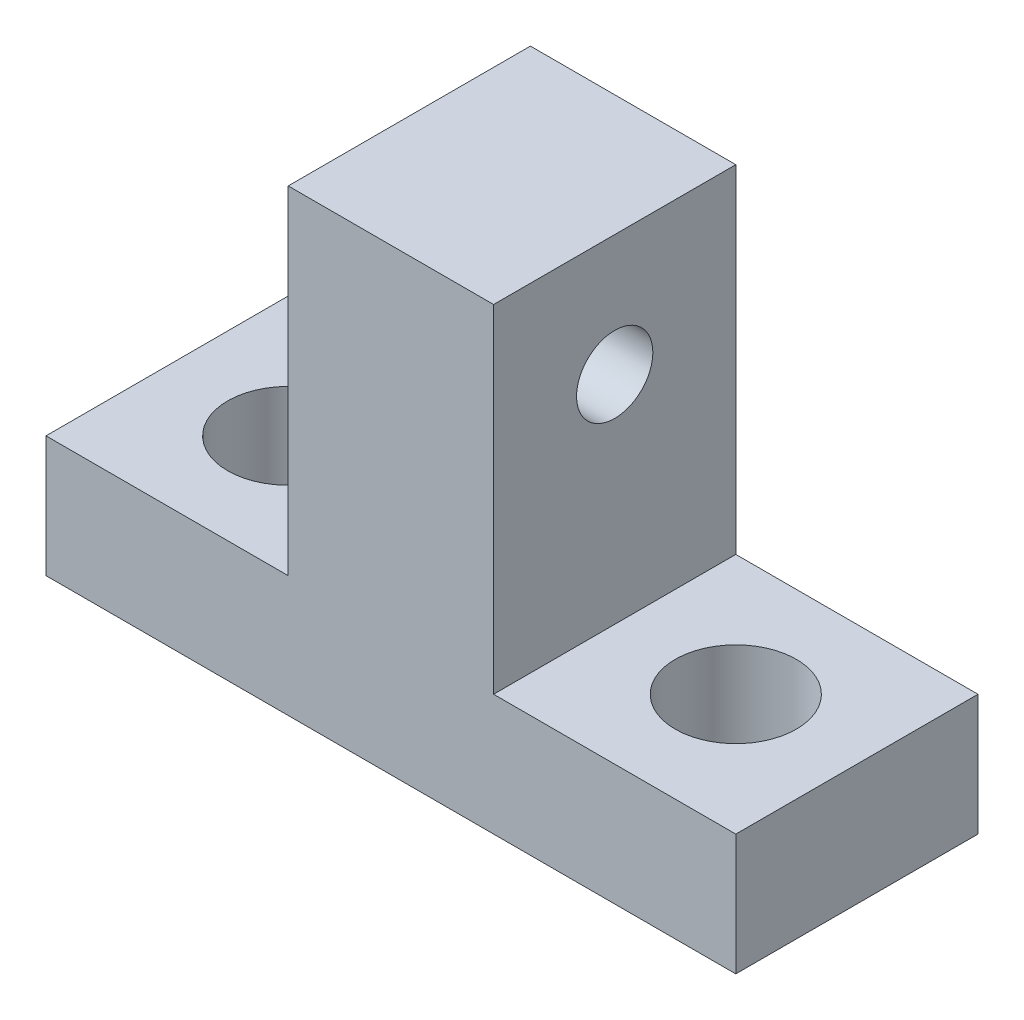
ISO-10303-21;
HEADER;
FILE_DESCRIPTION(('STEP AP214'),'2;1');
FILE_NAME('part.step','',(''),(''),'','','');
FILE_SCHEMA(('AUTOMOTIVE_DESIGN { 1 0 10303 214 1 1 1 1 }'));
ENDSEC;
DATA;
#1=APPLICATION_CONTEXT('core data for automotive mechanical design processes');
#2=APPLICATION_PROTOCOL_DEFINITION('international standard','automotive_design',2000,#1);
#3=PRODUCT_CONTEXT('',#1,'mechanical');
#4=PRODUCT('Part','Part','',(#3));
#5=PRODUCT_RELATED_PRODUCT_CATEGORY('part','',(#4));
#6=PRODUCT_DEFINITION_FORMATION('','',#4);
#7=PRODUCT_DEFINITION_CONTEXT('part definition',#1,'design');
#8=PRODUCT_DEFINITION('design','',#6,#7);
#9=PRODUCT_DEFINITION_SHAPE('','',#8);
#10=(LENGTH_UNIT() NAMED_UNIT(*) SI_UNIT(.MILLI.,.METRE.));
#11=(NAMED_UNIT(*) PLANE_ANGLE_UNIT() SI_UNIT($,.RADIAN.));
#12=(NAMED_UNIT(*) SI_UNIT($,.STERADIAN.) SOLID_ANGLE_UNIT());
#13=UNCERTAINTY_MEASURE_WITH_UNIT(LENGTH_MEASURE(1.E-05),#10,'distance_accuracy_value','');
#14=(GEOMETRIC_REPRESENTATION_CONTEXT(3) GLOBAL_UNCERTAINTY_ASSIGNED_CONTEXT((#13)) GLOBAL_UNIT_ASSIGNED_CONTEXT((#10,
#11,#12)) REPRESENTATION_CONTEXT('',''));
#15=CARTESIAN_POINT('',(0.,0.,0.));
#16=DIRECTION('',(0.,0.,1.));
#17=DIRECTION('',(1.,0.,0.));
#18=AXIS2_PLACEMENT_3D('',#15,#16,#17);
#19=CARTESIAN_POINT('',(18.0848,0.,12.7));
#20=DIRECTION('',(1.,0.,0.));
#21=DIRECTION('',(0.,1.,0.));
#22=AXIS2_PLACEMENT_3D('',#19,#20,#21);
#23=PLANE('',#22);
#24=DIRECTION('',(0.,-1.,0.));
#25=VECTOR('',#24,1.);
#26=CARTESIAN_POINT('',(18.0848,0.,0.));
#27=LINE('',#26,#25);
#28=CARTESIAN_POINT('',(18.0848,-8.8495,0.));
#29=VERTEX_POINT('',#28);
#30=CARTESIAN_POINT('',(18.0848,-15.1995,0.));
#31=VERTEX_POINT('',#30);
#32=EDGE_CURVE('E186',#29,#31,#27,.T.);
#33=ORIENTED_EDGE('',*,*,#32,.F.);
#34=DIRECTION('',(0.,0.,-1.));
#35=VECTOR('',#34,1.);
#36=CARTESIAN_POINT('',(18.0848,-8.8495,12.7));
#37=LINE('',#36,#35);
#38=CARTESIAN_POINT('',(18.0848,-8.8495,12.7));
#39=VERTEX_POINT('',#38);
#40=EDGE_CURVE('E11',#39,#29,#37,.T.);
#41=ORIENTED_EDGE('',*,*,#40,.F.);
#42=DIRECTION('',(0.,-1.,0.));
#43=VECTOR('',#42,1.);
#44=CARTESIAN_POINT('',(18.0848,0.,12.7));
#45=LINE('',#44,#43);
#46=CARTESIAN_POINT('',(18.0848,-15.1995,12.7));
#47=VERTEX_POINT('',#46);
#48=EDGE_CURVE('E132',#39,#47,#45,.T.);
#49=ORIENTED_EDGE('',*,*,#48,.T.);
#50=DIRECTION('',(0.,0.,-1.));
#51=VECTOR('',#50,1.);
#52=CARTESIAN_POINT('',(18.0848,-15.1995,12.7));
#53=LINE('',#52,#51);
#54=EDGE_CURVE('E87',#47,#31,#53,.T.);
#55=ORIENTED_EDGE('',*,*,#54,.T.);
#56=EDGE_LOOP('',(#33,#41,#49,#55));
#57=FACE_BOUND('',#56,.T.);
#58=ADVANCED_FACE('F36',(#57),#23,.T.);
#59=CARTESIAN_POINT('',(0.,-8.8495,12.7));
#60=DIRECTION('',(0.,1.,0.));
#61=DIRECTION('',(0.,0.,1.));
#62=AXIS2_PLACEMENT_3D('',#59,#60,#61);
#63=PLANE('',#62);
#64=CARTESIAN_POINT('',(11.7348,-8.8495,6.35));
#65=DIRECTION('',(0.,1.,0.));
#66=DIRECTION('',(0.,0.,1.));
#67=AXIS2_PLACEMENT_3D('',#64,#65,#66);
#68=CIRCLE('',#67,3.175);
#69=CARTESIAN_POINT('',(11.7348,-8.8495,9.525));
#70=VERTEX_POINT('',#69);
#71=EDGE_CURVE('E143',#70,#70,#68,.T.);
#72=ORIENTED_EDGE('',*,*,#71,.F.);
#73=EDGE_LOOP('',(#72));
#74=FACE_BOUND('',#73,.T.);
#75=DIRECTION('',(1.,0.,0.));
#76=VECTOR('',#75,1.);
#77=CARTESIAN_POINT('',(0.,-8.8495,0.));
#78=LINE('',#77,#76);
#79=CARTESIAN_POINT('',(5.3848,-8.8495,0.));
#80=VERTEX_POINT('',#79);
#81=EDGE_CURVE('E190',#80,#29,#78,.T.);
#82=ORIENTED_EDGE('',*,*,#81,.F.);
#83=DIRECTION('',(0.,0.,-1.));
#84=VECTOR('',#83,1.);
#85=CARTESIAN_POINT('',(5.3848,-8.8495,12.7));
#86=LINE('',#85,#84);
#87=CARTESIAN_POINT('',(5.3848,-8.8495,12.7));
#88=VERTEX_POINT('',#87);
#89=EDGE_CURVE('E45',#88,#80,#86,.T.);
#90=ORIENTED_EDGE('',*,*,#89,.F.);
#91=DIRECTION('',(1.,0.,0.));
#92=VECTOR('',#91,1.);
#93=CARTESIAN_POINT('',(0.,-8.8495,12.7));
#94=LINE('',#93,#92);
#95=EDGE_CURVE('E125',#88,#39,#94,.T.);
#96=ORIENTED_EDGE('',*,*,#95,.T.);
#97=ORIENTED_EDGE('',*,*,#40,.T.);
#98=EDGE_LOOP('',(#82,#90,#96,#97));
#99=FACE_BOUND('',#98,.T.);
#100=ADVANCED_FACE('F168',(#74,#99),#63,.T.);
#101=CARTESIAN_POINT('',(5.3848,0.,12.7));
#102=DIRECTION('',(1.,0.,0.));
#103=DIRECTION('',(0.,1.,0.));
#104=AXIS2_PLACEMENT_3D('',#101,#102,#103);
#105=PLANE('',#104);
#106=CARTESIAN_POINT('',(5.3848,2.4995,6.35));
#107=DIRECTION('',(1.,0.,0.));
#108=DIRECTION('',(0.,1.,0.));
#109=AXIS2_PLACEMENT_3D('',#106,#107,#108);
#110=CIRCLE('',#109,2.);
#111=CARTESIAN_POINT('',(5.3848,4.4995,6.35));
#112=VERTEX_POINT('',#111);
#113=EDGE_CURVE('E139',#112,#112,#110,.T.);
#114=ORIENTED_EDGE('',*,*,#113,.F.);
#115=EDGE_LOOP('',(#114));
#116=FACE_BOUND('',#115,.T.);
#117=DIRECTION('',(0.,-1.,0.));
#118=VECTOR('',#117,1.);
#119=CARTESIAN_POINT('',(5.3848,0.,0.));
#120=LINE('',#119,#118);
#121=CARTESIAN_POINT('',(5.3848,8.8495,0.));
#122=VERTEX_POINT('',#121);
#123=EDGE_CURVE('E197',#122,#80,#120,.T.);
#124=ORIENTED_EDGE('',*,*,#123,.F.);
#125=DIRECTION('',(0.,0.,-1.));
#126=VECTOR('',#125,1.);
#127=CARTESIAN_POINT('',(5.3848,8.8495,12.7));
#128=LINE('',#127,#126);
#129=CARTESIAN_POINT('',(5.3848,8.8495,12.7));
#130=VERTEX_POINT('',#129);
#131=EDGE_CURVE('E215',#130,#122,#128,.T.);
#132=ORIENTED_EDGE('',*,*,#131,.F.);
#133=DIRECTION('',(0.,-1.,0.));
#134=VECTOR('',#133,1.);
#135=CARTESIAN_POINT('',(5.3848,0.,12.7));
#136=LINE('',#135,#134);
#137=EDGE_CURVE('E131',#130,#88,#136,.T.);
#138=ORIENTED_EDGE('',*,*,#137,.T.);
#139=ORIENTED_EDGE('',*,*,#89,.T.);
#140=EDGE_LOOP('',(#124,#132,#138,#139));
#141=FACE_BOUND('',#140,.T.);
#142=ADVANCED_FACE('F179',(#116,#141),#105,.T.);
#143=CARTESIAN_POINT('',(0.,8.8495,12.7));
#144=DIRECTION('',(0.,-1.,0.));
#145=DIRECTION('',(1.,0.,0.));
#146=AXIS2_PLACEMENT_3D('',#143,#144,#145);
#147=PLANE('',#146);
#148=DIRECTION('',(-1.,0.,0.));
#149=VECTOR('',#148,1.);
#150=CARTESIAN_POINT('',(0.,8.8495,0.));
#151=LINE('',#150,#149);
#152=CARTESIAN_POINT('',(-5.3848,8.8495,0.));
#153=VERTEX_POINT('',#152);
#154=EDGE_CURVE('E199',#122,#153,#151,.T.);
#155=ORIENTED_EDGE('',*,*,#154,.T.);
#156=DIRECTION('',(0.,0.,-1.));
#157=VECTOR('',#156,1.);
#158=CARTESIAN_POINT('',(-5.3848,8.8495,12.7));
#159=LINE('',#158,#157);
#160=CARTESIAN_POINT('',(-5.3848,8.8495,12.7));
#161=VERTEX_POINT('',#160);
#162=EDGE_CURVE('E213',#161,#153,#159,.T.);
#163=ORIENTED_EDGE('',*,*,#162,.F.);
#164=DIRECTION('',(-1.,0.,0.));
#165=VECTOR('',#164,1.);
#166=CARTESIAN_POINT('',(0.,8.8495,12.7));
#167=LINE('',#166,#165);
#168=EDGE_CURVE('E126',#130,#161,#167,.T.);
#169=ORIENTED_EDGE('',*,*,#168,.F.);
#170=ORIENTED_EDGE('',*,*,#131,.T.);
#171=EDGE_LOOP('',(#155,#163,#169,#170));
#172=FACE_BOUND('',#171,.T.);
#173=ADVANCED_FACE('F176',(#172),#147,.F.);
#174=CARTESIAN_POINT('',(-5.3848,0.,12.7));
#175=DIRECTION('',(1.,0.,0.));
#176=DIRECTION('',(0.,1.,0.));
#177=AXIS2_PLACEMENT_3D('',#174,#175,#176);
#178=PLANE('',#177);
#179=CARTESIAN_POINT('',(-5.3848,2.4995,6.35));
#180=DIRECTION('',(1.,0.,0.));
#181=DIRECTION('',(0.,1.,0.));
#182=AXIS2_PLACEMENT_3D('',#179,#180,#181);
#183=CIRCLE('',#182,2.);
#184=CARTESIAN_POINT('',(-5.3848,4.4995,6.35));
#185=VERTEX_POINT('',#184);
#186=EDGE_CURVE('E39',#185,#185,#183,.T.);
#187=ORIENTED_EDGE('',*,*,#186,.T.);
#188=EDGE_LOOP('',(#187));
#189=FACE_BOUND('',#188,.T.);
#190=DIRECTION('',(0.,-1.,0.));
#191=VECTOR('',#190,1.);
#192=CARTESIAN_POINT('',(-5.3848,0.,0.));
#193=LINE('',#192,#191);
#194=CARTESIAN_POINT('',(-5.3848,-8.8495,0.));
#195=VERTEX_POINT('',#194);
#196=EDGE_CURVE('E201',#153,#195,#193,.T.);
#197=ORIENTED_EDGE('',*,*,#196,.T.);
#198=DIRECTION('',(0.,0.,-1.));
#199=VECTOR('',#198,1.);
#200=CARTESIAN_POINT('',(-5.3848,-8.8495,12.7));
#201=LINE('',#200,#199);
#202=CARTESIAN_POINT('',(-5.3848,-8.8495,12.7));
#203=VERTEX_POINT('',#202);
#204=EDGE_CURVE('E114',#203,#195,#201,.T.);
#205=ORIENTED_EDGE('',*,*,#204,.F.);
#206=DIRECTION('',(0.,-1.,0.));
#207=VECTOR('',#206,1.);
#208=CARTESIAN_POINT('',(-5.3848,0.,12.7));
#209=LINE('',#208,#207);
#210=EDGE_CURVE('E122',#161,#203,#209,.T.);
#211=ORIENTED_EDGE('',*,*,#210,.F.);
#212=ORIENTED_EDGE('',*,*,#162,.T.);
#213=EDGE_LOOP('',(#197,#205,#211,#212));
#214=FACE_BOUND('',#213,.T.);
#215=ADVANCED_FACE('F166',(#189,#214),#178,.F.);
#216=CARTESIAN_POINT('',(-11.7348,-8.8495,6.35));
#217=DIRECTION('',(0.,1.,0.));
#218=DIRECTION('',(0.,0.,1.));
#219=AXIS2_PLACEMENT_3D('',#216,#217,#218);
#220=CIRCLE('',#219,3.175);
#221=CARTESIAN_POINT('',(-11.7348,-8.8495,9.525));
#222=VERTEX_POINT('',#221);
#223=EDGE_CURVE('E149',#222,#222,#220,.T.);
#224=ORIENTED_EDGE('',*,*,#223,.F.);
#225=EDGE_LOOP('',(#224));
#226=FACE_BOUND('',#225,.T.);
#227=CARTESIAN_POINT('',(-18.0848,-8.8495,0.));
#228=VERTEX_POINT('',#227);
#229=EDGE_CURVE('E113',#228,#195,#78,.T.);
#230=ORIENTED_EDGE('',*,*,#229,.F.);
#231=DIRECTION('',(0.,0.,-1.));
#232=VECTOR('',#231,1.);
#233=CARTESIAN_POINT('',(-18.0848,-8.8495,12.7));
#234=LINE('',#233,#232);
#235=CARTESIAN_POINT('',(-18.0848,-8.8495,12.7));
#236=VERTEX_POINT('',#235);
#237=EDGE_CURVE('E107',#236,#228,#234,.T.);
#238=ORIENTED_EDGE('',*,*,#237,.F.);
#239=EDGE_CURVE('E111',#236,#203,#94,.T.);
#240=ORIENTED_EDGE('',*,*,#239,.T.);
#241=ORIENTED_EDGE('',*,*,#204,.T.);
#242=EDGE_LOOP('',(#230,#238,#240,#241));
#243=FACE_BOUND('',#242,.T.);
#244=ADVANCED_FACE('F109',(#226,#243),#63,.T.);
#245=CARTESIAN_POINT('',(-18.0848,0.,12.7));
#246=DIRECTION('',(1.,0.,0.));
#247=DIRECTION('',(0.,1.,0.));
#248=AXIS2_PLACEMENT_3D('',#245,#246,#247);
#249=PLANE('',#248);
#250=DIRECTION('',(0.,-1.,0.));
#251=VECTOR('',#250,1.);
#252=CARTESIAN_POINT('',(-18.0848,0.,0.));
#253=LINE('',#252,#251);
#254=CARTESIAN_POINT('',(-18.0848,-15.1995,0.));
#255=VERTEX_POINT('',#254);
#256=EDGE_CURVE('E80',#228,#255,#253,.T.);
#257=ORIENTED_EDGE('',*,*,#256,.T.);
#258=DIRECTION('',(0.,0.,-1.));
#259=VECTOR('',#258,1.);
#260=CARTESIAN_POINT('',(-18.0848,-15.1995,12.7));
#261=LINE('',#260,#259);
#262=CARTESIAN_POINT('',(-18.0848,-15.1995,12.7));
#263=VERTEX_POINT('',#262);
#264=EDGE_CURVE('E115',#263,#255,#261,.T.);
#265=ORIENTED_EDGE('',*,*,#264,.F.);
#266=DIRECTION('',(0.,-1.,0.));
#267=VECTOR('',#266,1.);
#268=CARTESIAN_POINT('',(-18.0848,0.,12.7));
#269=LINE('',#268,#267);
#270=EDGE_CURVE('E117',#236,#263,#269,.T.);
#271=ORIENTED_EDGE('',*,*,#270,.F.);
#272=ORIENTED_EDGE('',*,*,#237,.T.);
#273=EDGE_LOOP('',(#257,#265,#271,#272));
#274=FACE_BOUND('',#273,.T.);
#275=ADVANCED_FACE('F118',(#274),#249,.F.);
#276=CARTESIAN_POINT('',(0.,-15.1995,12.7));
#277=DIRECTION('',(0.,1.,0.));
#278=DIRECTION('',(0.,0.,1.));
#279=AXIS2_PLACEMENT_3D('',#276,#277,#278);
#280=PLANE('',#279);
#281=CARTESIAN_POINT('',(-11.7348,-15.1995,6.35));
#282=DIRECTION('',(0.,1.,0.));
#283=DIRECTION('',(0.,0.,1.));
#284=AXIS2_PLACEMENT_3D('',#281,#282,#283);
#285=CIRCLE('',#284,3.175);
#286=CARTESIAN_POINT('',(-11.7348,-15.1995,9.525));
#287=VERTEX_POINT('',#286);
#288=EDGE_CURVE('E142',#287,#287,#285,.T.);
#289=ORIENTED_EDGE('',*,*,#288,.T.);
#290=EDGE_LOOP('',(#289));
#291=FACE_BOUND('',#290,.T.);
#292=CARTESIAN_POINT('',(11.7348,-15.1995,6.35));
#293=DIRECTION('',(0.,1.,0.));
#294=DIRECTION('',(0.,0.,1.));
#295=AXIS2_PLACEMENT_3D('',#292,#293,#294);
#296=CIRCLE('',#295,3.175);
#297=CARTESIAN_POINT('',(11.7348,-15.1995,9.525));
#298=VERTEX_POINT('',#297);
#299=EDGE_CURVE('E146',#298,#298,#296,.T.);
#300=ORIENTED_EDGE('',*,*,#299,.T.);
#301=EDGE_LOOP('',(#300));
#302=FACE_BOUND('',#301,.T.);
#303=DIRECTION('',(1.,0.,0.));
#304=VECTOR('',#303,1.);
#305=CARTESIAN_POINT('',(0.,-15.1995,0.));
#306=LINE('',#305,#304);
#307=EDGE_CURVE('E136',#255,#31,#306,.T.);
#308=ORIENTED_EDGE('',*,*,#307,.T.);
#309=ORIENTED_EDGE('',*,*,#54,.F.);
#310=DIRECTION('',(1.,0.,0.));
#311=VECTOR('',#310,1.);
#312=CARTESIAN_POINT('',(0.,-15.1995,12.7));
#313=LINE('',#312,#311);
#314=EDGE_CURVE('E53',#263,#47,#313,.T.);
#315=ORIENTED_EDGE('',*,*,#314,.F.);
#316=ORIENTED_EDGE('',*,*,#264,.T.);
#317=EDGE_LOOP('',(#308,#309,#315,#316));
#318=FACE_BOUND('',#317,.T.);
#319=ADVANCED_FACE('F155',(#291,#302,#318),#280,.F.);
#320=CARTESIAN_POINT('',(0.,0.,12.7));
#321=DIRECTION('',(0.,0.,1.));
#322=DIRECTION('',(1.,0.,0.));
#323=AXIS2_PLACEMENT_3D('',#320,#321,#322);
#324=PLANE('',#323);
#325=ORIENTED_EDGE('',*,*,#48,.F.);
#326=ORIENTED_EDGE('',*,*,#95,.F.);
#327=ORIENTED_EDGE('',*,*,#137,.F.);
#328=ORIENTED_EDGE('',*,*,#168,.T.);
#329=ORIENTED_EDGE('',*,*,#210,.T.);
#330=ORIENTED_EDGE('',*,*,#239,.F.);
#331=ORIENTED_EDGE('',*,*,#270,.T.);
#332=ORIENTED_EDGE('',*,*,#314,.T.);
#333=EDGE_LOOP('',(#325,#326,#327,#328,#329,#330,#331,#332));
#334=FACE_BOUND('',#333,.T.);
#335=ADVANCED_FACE('F120',(#334),#324,.T.);
#336=CARTESIAN_POINT('',(0.,0.,0.));
#337=DIRECTION('',(0.,0.,1.));
#338=DIRECTION('',(1.,0.,0.));
#339=AXIS2_PLACEMENT_3D('',#336,#337,#338);
#340=PLANE('',#339);
#341=ORIENTED_EDGE('',*,*,#32,.T.);
#342=ORIENTED_EDGE('',*,*,#307,.F.);
#343=ORIENTED_EDGE('',*,*,#256,.F.);
#344=ORIENTED_EDGE('',*,*,#229,.T.);
#345=ORIENTED_EDGE('',*,*,#196,.F.);
#346=ORIENTED_EDGE('',*,*,#154,.F.);
#347=ORIENTED_EDGE('',*,*,#123,.T.);
#348=ORIENTED_EDGE('',*,*,#81,.T.);
#349=EDGE_LOOP('',(#341,#342,#343,#344,#345,#346,#347,#348));
#350=FACE_BOUND('',#349,.T.);
#351=ADVANCED_FACE('F194',(#350),#340,.F.);
#352=CARTESIAN_POINT('',(-18.0848,2.4995,6.35));
#353=DIRECTION('',(1.,0.,0.));
#354=DIRECTION('',(0.,1.,0.));
#355=AXIS2_PLACEMENT_3D('',#352,#353,#354);
#356=CYLINDRICAL_SURFACE('',#355,2.);
#357=ORIENTED_EDGE('',*,*,#113,.T.);
#358=EDGE_LOOP('',(#357));
#359=FACE_BOUND('',#358,.T.);
#360=ORIENTED_EDGE('',*,*,#186,.F.);
#361=EDGE_LOOP('',(#360));
#362=FACE_BOUND('',#361,.T.);
#363=ADVANCED_FACE('F233',(#359,#362),#356,.F.);
#364=CARTESIAN_POINT('',(11.7348,-15.1995,6.35));
#365=DIRECTION('',(0.,1.,0.));
#366=DIRECTION('',(0.,0.,1.));
#367=AXIS2_PLACEMENT_3D('',#364,#365,#366);
#368=CYLINDRICAL_SURFACE('',#367,3.175);
#369=ORIENTED_EDGE('',*,*,#299,.F.);
#370=EDGE_LOOP('',(#369));
#371=FACE_BOUND('',#370,.T.);
#372=ORIENTED_EDGE('',*,*,#71,.T.);
#373=EDGE_LOOP('',(#372));
#374=FACE_BOUND('',#373,.T.);
#375=ADVANCED_FACE('F161',(#371,#374),#368,.F.);
#376=CARTESIAN_POINT('',(-11.7348,-15.1995,6.35));
#377=DIRECTION('',(0.,1.,0.));
#378=DIRECTION('',(0.,0.,1.));
#379=AXIS2_PLACEMENT_3D('',#376,#377,#378);
#380=CYLINDRICAL_SURFACE('',#379,3.175);
#381=ORIENTED_EDGE('',*,*,#288,.F.);
#382=EDGE_LOOP('',(#381));
#383=FACE_BOUND('',#382,.T.);
#384=ORIENTED_EDGE('',*,*,#223,.T.);
#385=EDGE_LOOP('',(#384));
#386=FACE_BOUND('',#385,.T.);
#387=ADVANCED_FACE('F158',(#383,#386),#380,.F.);
#388=CLOSED_SHELL('',(#58,#100,#142,#173,#215,#244,#275,#319,#335,#351,#363,#375,#387));
#389=MANIFOLD_SOLID_BREP('B2',#388);
#390=ADVANCED_BREP_SHAPE_REPRESENTATION('',(#18,#389),#14);
#391=SHAPE_DEFINITION_REPRESENTATION(#9,#390);
ENDSEC;
END-ISO-10303-21;
